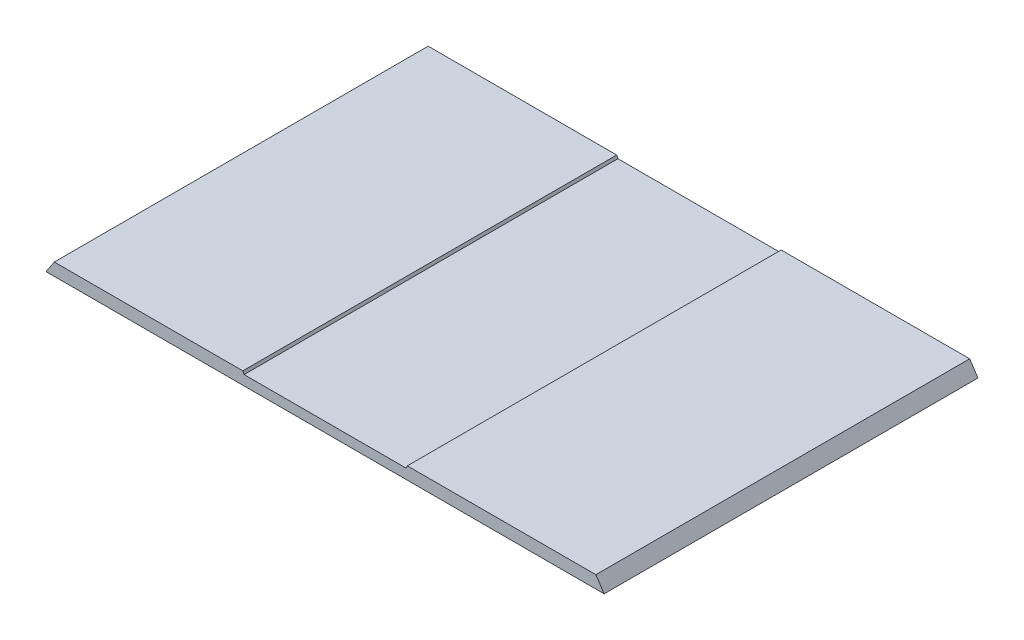
ISO-10303-21;
HEADER;
FILE_DESCRIPTION(('STEP AP214'),'2;1');
FILE_NAME('part.step','',(''),(''),'','','');
FILE_SCHEMA(('AUTOMOTIVE_DESIGN { 1 0 10303 214 1 1 1 1 }'));
ENDSEC;
DATA;
#1=APPLICATION_CONTEXT('core data for automotive mechanical design processes');
#2=APPLICATION_PROTOCOL_DEFINITION('international standard','automotive_design',2000,#1);
#3=PRODUCT_CONTEXT('',#1,'mechanical');
#4=PRODUCT('Part','Part','',(#3));
#5=PRODUCT_RELATED_PRODUCT_CATEGORY('part','',(#4));
#6=PRODUCT_DEFINITION_FORMATION('','',#4);
#7=PRODUCT_DEFINITION_CONTEXT('part definition',#1,'design');
#8=PRODUCT_DEFINITION('design','',#6,#7);
#9=PRODUCT_DEFINITION_SHAPE('','',#8);
#10=(LENGTH_UNIT() NAMED_UNIT(*) SI_UNIT(.MILLI.,.METRE.));
#11=(NAMED_UNIT(*) PLANE_ANGLE_UNIT() SI_UNIT($,.RADIAN.));
#12=(NAMED_UNIT(*) SI_UNIT($,.STERADIAN.) SOLID_ANGLE_UNIT());
#13=UNCERTAINTY_MEASURE_WITH_UNIT(LENGTH_MEASURE(1.E-05),#10,'distance_accuracy_value','');
#14=(GEOMETRIC_REPRESENTATION_CONTEXT(3) GLOBAL_UNCERTAINTY_ASSIGNED_CONTEXT((#13)) GLOBAL_UNIT_ASSIGNED_CONTEXT((#10,
#11,#12)) REPRESENTATION_CONTEXT('',''));
#15=CARTESIAN_POINT('',(0.,0.,0.));
#16=DIRECTION('',(0.,0.,1.));
#17=DIRECTION('',(1.,0.,0.));
#18=AXIS2_PLACEMENT_3D('',#15,#16,#17);
#19=CARTESIAN_POINT('',(335.914239770225,-194.367647058824,450.));
#20=DIRECTION('',(0.,1.,0.));
#21=DIRECTION('',(0.,0.,1.));
#22=AXIS2_PLACEMENT_3D('',#19,#20,#21);
#23=PLANE('',#22);
#24=DIRECTION('',(1.,0.,0.));
#25=VECTOR('',#24,1.);
#26=CARTESIAN_POINT('',(335.914239770225,-194.367647058824,0.));
#27=LINE('',#26,#25);
#28=CARTESIAN_POINT('',(-335.914239770225,-194.367647058824,0.));
#29=VERTEX_POINT('',#28);
#30=CARTESIAN_POINT('',(335.914239770225,-194.367647058824,0.));
#31=VERTEX_POINT('',#30);
#32=EDGE_CURVE('E129',#29,#31,#27,.T.);
#33=ORIENTED_EDGE('',*,*,#32,.T.);
#34=DIRECTION('',(0.,0.,-1.));
#35=VECTOR('',#34,1.);
#36=CARTESIAN_POINT('',(335.914239770225,-194.367647058824,450.));
#37=LINE('',#36,#35);
#38=CARTESIAN_POINT('',(335.914239770225,-194.367647058824,450.));
#39=VERTEX_POINT('',#38);
#40=EDGE_CURVE('E11',#39,#31,#37,.T.);
#41=ORIENTED_EDGE('',*,*,#40,.F.);
#42=DIRECTION('',(1.,0.,0.));
#43=VECTOR('',#42,1.);
#44=CARTESIAN_POINT('',(335.914239770225,-194.367647058824,450.));
#45=LINE('',#44,#43);
#46=CARTESIAN_POINT('',(-335.914239770225,-194.367647058824,450.));
#47=VERTEX_POINT('',#46);
#48=EDGE_CURVE('E143',#47,#39,#45,.T.);
#49=ORIENTED_EDGE('',*,*,#48,.F.);
#50=DIRECTION('',(0.,0.,-1.));
#51=VECTOR('',#50,1.);
#52=CARTESIAN_POINT('',(-335.914239770225,-194.367647058824,450.));
#53=LINE('',#52,#51);
#54=EDGE_CURVE('E125',#47,#29,#53,.T.);
#55=ORIENTED_EDGE('',*,*,#54,.T.);
#56=EDGE_LOOP('',(#33,#41,#49,#55));
#57=FACE_BOUND('',#56,.T.);
#58=ADVANCED_FACE('F33',(#57),#23,.F.);
#59=CARTESIAN_POINT('',(325.914239770225,-179.367647058824,450.));
#60=DIRECTION('',(-0.832050294337846,-0.554700196225226,0.));
#61=DIRECTION('',(0.554700196225226,-0.832050294337846,0.));
#62=AXIS2_PLACEMENT_3D('',#59,#60,#61);
#63=PLANE('',#62);
#64=DIRECTION('',(-0.554700196225226,0.832050294337846,0.));
#65=VECTOR('',#64,1.);
#66=CARTESIAN_POINT('',(325.914239770225,-179.367647058824,0.));
#67=LINE('',#66,#65);
#68=CARTESIAN_POINT('',(325.914239770225,-179.367647058824,0.));
#69=VERTEX_POINT('',#68);
#70=EDGE_CURVE('E132',#31,#69,#67,.T.);
#71=ORIENTED_EDGE('',*,*,#70,.T.);
#72=DIRECTION('',(0.,0.,-1.));
#73=VECTOR('',#72,1.);
#74=CARTESIAN_POINT('',(325.914239770225,-179.367647058824,450.));
#75=LINE('',#74,#73);
#76=CARTESIAN_POINT('',(325.914239770225,-179.367647058824,450.));
#77=VERTEX_POINT('',#76);
#78=EDGE_CURVE('E41',#77,#69,#75,.T.);
#79=ORIENTED_EDGE('',*,*,#78,.F.);
#80=DIRECTION('',(-0.554700196225226,0.832050294337846,0.));
#81=VECTOR('',#80,1.);
#82=CARTESIAN_POINT('',(325.914239770225,-179.367647058824,450.));
#83=LINE('',#82,#81);
#84=EDGE_CURVE('E92',#39,#77,#83,.T.);
#85=ORIENTED_EDGE('',*,*,#84,.F.);
#86=ORIENTED_EDGE('',*,*,#40,.T.);
#87=EDGE_LOOP('',(#71,#79,#85,#86));
#88=FACE_BOUND('',#87,.T.);
#89=ADVANCED_FACE('F178',(#88),#63,.F.);
#90=CARTESIAN_POINT('',(98.9999999999999,-179.367647058824,450.));
#91=DIRECTION('',(0.,-1.,0.));
#92=DIRECTION('',(0.,0.,-1.));
#93=AXIS2_PLACEMENT_3D('',#90,#91,#92);
#94=PLANE('',#93);
#95=DIRECTION('',(-1.,0.,0.));
#96=VECTOR('',#95,1.);
#97=CARTESIAN_POINT('',(98.9999999999999,-179.367647058824,0.));
#98=LINE('',#97,#96);
#99=CARTESIAN_POINT('',(98.9999999999999,-179.367647058824,0.));
#100=VERTEX_POINT('',#99);
#101=EDGE_CURVE('E134',#69,#100,#98,.T.);
#102=ORIENTED_EDGE('',*,*,#101,.T.);
#103=DIRECTION('',(0.,0.,-1.));
#104=VECTOR('',#103,1.);
#105=CARTESIAN_POINT('',(98.9999999999999,-179.367647058824,450.));
#106=LINE('',#105,#104);
#107=CARTESIAN_POINT('',(98.9999999999999,-179.367647058824,450.));
#108=VERTEX_POINT('',#107);
#109=EDGE_CURVE('E150',#108,#100,#106,.T.);
#110=ORIENTED_EDGE('',*,*,#109,.F.);
#111=DIRECTION('',(-1.,0.,0.));
#112=VECTOR('',#111,1.);
#113=CARTESIAN_POINT('',(98.9999999999999,-179.367647058824,450.));
#114=LINE('',#113,#112);
#115=EDGE_CURVE('E158',#77,#108,#114,.T.);
#116=ORIENTED_EDGE('',*,*,#115,.F.);
#117=ORIENTED_EDGE('',*,*,#78,.T.);
#118=EDGE_LOOP('',(#102,#110,#116,#117));
#119=FACE_BOUND('',#118,.T.);
#120=ADVANCED_FACE('F156',(#119),#94,.F.);
#121=CARTESIAN_POINT('',(98.9999999999999,-179.367647058824,450.));
#122=DIRECTION('',(0.901919134345838,-0.431904937574062,0.));
#123=DIRECTION('',(0.431904937574062,0.901919134345838,0.));
#124=AXIS2_PLACEMENT_3D('',#121,#122,#123);
#125=PLANE('',#124);
#126=DIRECTION('',(-0.431904937574062,-0.901919134345838,0.));
#127=VECTOR('',#126,1.);
#128=CARTESIAN_POINT('',(98.9999999999999,-179.367647058824,0.));
#129=LINE('',#128,#127);
#130=CARTESIAN_POINT('',(97.5,-182.5,0.));
#131=VERTEX_POINT('',#130);
#132=EDGE_CURVE('E136',#100,#131,#129,.T.);
#133=ORIENTED_EDGE('',*,*,#132,.T.);
#134=DIRECTION('',(0.,0.,-1.));
#135=VECTOR('',#134,1.);
#136=CARTESIAN_POINT('',(97.5,-182.5,450.));
#137=LINE('',#136,#135);
#138=CARTESIAN_POINT('',(97.5,-182.5,450.));
#139=VERTEX_POINT('',#138);
#140=EDGE_CURVE('E147',#139,#131,#137,.T.);
#141=ORIENTED_EDGE('',*,*,#140,.F.);
#142=DIRECTION('',(-0.431904937574062,-0.901919134345838,0.));
#143=VECTOR('',#142,1.);
#144=CARTESIAN_POINT('',(98.9999999999999,-179.367647058824,450.));
#145=LINE('',#144,#143);
#146=EDGE_CURVE('E170',#108,#139,#145,.T.);
#147=ORIENTED_EDGE('',*,*,#146,.F.);
#148=ORIENTED_EDGE('',*,*,#109,.T.);
#149=EDGE_LOOP('',(#133,#141,#147,#148));
#150=FACE_BOUND('',#149,.T.);
#151=ADVANCED_FACE('F166',(#150),#125,.F.);
#152=CARTESIAN_POINT('',(97.5,-182.5,450.));
#153=DIRECTION('',(0.,-1.,0.));
#154=DIRECTION('',(0.,0.,-1.));
#155=AXIS2_PLACEMENT_3D('',#152,#153,#154);
#156=PLANE('',#155);
#157=DIRECTION('',(-1.,0.,0.));
#158=VECTOR('',#157,1.);
#159=CARTESIAN_POINT('',(97.5,-182.5,0.));
#160=LINE('',#159,#158);
#161=CARTESIAN_POINT('',(-97.5,-182.5,0.));
#162=VERTEX_POINT('',#161);
#163=EDGE_CURVE('E138',#131,#162,#160,.T.);
#164=ORIENTED_EDGE('',*,*,#163,.T.);
#165=DIRECTION('',(0.,0.,-1.));
#166=VECTOR('',#165,1.);
#167=CARTESIAN_POINT('',(-97.5,-182.5,450.));
#168=LINE('',#167,#166);
#169=CARTESIAN_POINT('',(-97.5,-182.5,450.));
#170=VERTEX_POINT('',#169);
#171=EDGE_CURVE('E120',#170,#162,#168,.T.);
#172=ORIENTED_EDGE('',*,*,#171,.F.);
#173=DIRECTION('',(-1.,0.,0.));
#174=VECTOR('',#173,1.);
#175=CARTESIAN_POINT('',(97.5,-182.5,450.));
#176=LINE('',#175,#174);
#177=EDGE_CURVE('E111',#139,#170,#176,.T.);
#178=ORIENTED_EDGE('',*,*,#177,.F.);
#179=ORIENTED_EDGE('',*,*,#140,.T.);
#180=EDGE_LOOP('',(#164,#172,#178,#179));
#181=FACE_BOUND('',#180,.T.);
#182=ADVANCED_FACE('F169',(#181),#156,.F.);
#183=CARTESIAN_POINT('',(-98.9999999999999,-179.367647058824,450.));
#184=DIRECTION('',(-0.901919134345838,-0.431904937574062,0.));
#185=DIRECTION('',(0.431904937574062,-0.901919134345838,0.));
#186=AXIS2_PLACEMENT_3D('',#183,#184,#185);
#187=PLANE('',#186);
#188=DIRECTION('',(-0.431904937574062,0.901919134345838,0.));
#189=VECTOR('',#188,1.);
#190=CARTESIAN_POINT('',(-98.9999999999999,-179.367647058824,0.));
#191=LINE('',#190,#189);
#192=CARTESIAN_POINT('',(-98.9999999999999,-179.367647058824,0.));
#193=VERTEX_POINT('',#192);
#194=EDGE_CURVE('E119',#162,#193,#191,.T.);
#195=ORIENTED_EDGE('',*,*,#194,.T.);
#196=DIRECTION('',(0.,0.,-1.));
#197=VECTOR('',#196,1.);
#198=CARTESIAN_POINT('',(-98.9999999999999,-179.367647058824,450.));
#199=LINE('',#198,#197);
#200=CARTESIAN_POINT('',(-98.9999999999999,-179.367647058824,450.));
#201=VERTEX_POINT('',#200);
#202=EDGE_CURVE('E116',#201,#193,#199,.T.);
#203=ORIENTED_EDGE('',*,*,#202,.F.);
#204=DIRECTION('',(-0.431904937574062,0.901919134345838,0.));
#205=VECTOR('',#204,1.);
#206=CARTESIAN_POINT('',(-98.9999999999999,-179.367647058824,450.));
#207=LINE('',#206,#205);
#208=EDGE_CURVE('E105',#170,#201,#207,.T.);
#209=ORIENTED_EDGE('',*,*,#208,.F.);
#210=ORIENTED_EDGE('',*,*,#171,.T.);
#211=EDGE_LOOP('',(#195,#203,#209,#210));
#212=FACE_BOUND('',#211,.T.);
#213=ADVANCED_FACE('F117',(#212),#187,.F.);
#214=CARTESIAN_POINT('',(-98.9999999999999,-179.367647058824,450.));
#215=DIRECTION('',(0.,-1.,0.));
#216=DIRECTION('',(0.,0.,-1.));
#217=AXIS2_PLACEMENT_3D('',#214,#215,#216);
#218=PLANE('',#217);
#219=DIRECTION('',(-1.,0.,0.));
#220=VECTOR('',#219,1.);
#221=CARTESIAN_POINT('',(-98.9999999999999,-179.367647058824,0.));
#222=LINE('',#221,#220);
#223=CARTESIAN_POINT('',(-325.914239770225,-179.367647058824,0.));
#224=VERTEX_POINT('',#223);
#225=EDGE_CURVE('E78',#193,#224,#222,.T.);
#226=ORIENTED_EDGE('',*,*,#225,.T.);
#227=DIRECTION('',(0.,0.,-1.));
#228=VECTOR('',#227,1.);
#229=CARTESIAN_POINT('',(-325.914239770225,-179.367647058824,450.));
#230=LINE('',#229,#228);
#231=CARTESIAN_POINT('',(-325.914239770225,-179.367647058824,450.));
#232=VERTEX_POINT('',#231);
#233=EDGE_CURVE('E121',#232,#224,#230,.T.);
#234=ORIENTED_EDGE('',*,*,#233,.F.);
#235=DIRECTION('',(-1.,0.,0.));
#236=VECTOR('',#235,1.);
#237=CARTESIAN_POINT('',(-98.9999999999999,-179.367647058824,450.));
#238=LINE('',#237,#236);
#239=EDGE_CURVE('E109',#201,#232,#238,.T.);
#240=ORIENTED_EDGE('',*,*,#239,.F.);
#241=ORIENTED_EDGE('',*,*,#202,.T.);
#242=EDGE_LOOP('',(#226,#234,#240,#241));
#243=FACE_BOUND('',#242,.T.);
#244=ADVANCED_FACE('F123',(#243),#218,.F.);
#245=CARTESIAN_POINT('',(-325.914239770225,-179.367647058824,450.));
#246=DIRECTION('',(0.832050294337846,-0.554700196225226,0.));
#247=DIRECTION('',(0.554700196225226,0.832050294337846,0.));
#248=AXIS2_PLACEMENT_3D('',#245,#246,#247);
#249=PLANE('',#248);
#250=DIRECTION('',(-0.554700196225226,-0.832050294337846,0.));
#251=VECTOR('',#250,1.);
#252=CARTESIAN_POINT('',(-325.914239770225,-179.367647058824,0.));
#253=LINE('',#252,#251);
#254=EDGE_CURVE('E84',#224,#29,#253,.T.);
#255=ORIENTED_EDGE('',*,*,#254,.T.);
#256=ORIENTED_EDGE('',*,*,#54,.F.);
#257=DIRECTION('',(-0.554700196225226,-0.832050294337846,0.));
#258=VECTOR('',#257,1.);
#259=CARTESIAN_POINT('',(-325.914239770225,-179.367647058824,450.));
#260=LINE('',#259,#258);
#261=EDGE_CURVE('E49',#232,#47,#260,.T.);
#262=ORIENTED_EDGE('',*,*,#261,.F.);
#263=ORIENTED_EDGE('',*,*,#233,.T.);
#264=EDGE_LOOP('',(#255,#256,#262,#263));
#265=FACE_BOUND('',#264,.T.);
#266=ADVANCED_FACE('F194',(#265),#249,.F.);
#267=CARTESIAN_POINT('',(0.,0.,450.));
#268=DIRECTION('',(0.,0.,1.));
#269=DIRECTION('',(1.,0.,0.));
#270=AXIS2_PLACEMENT_3D('',#267,#268,#269);
#271=PLANE('',#270);
#272=ORIENTED_EDGE('',*,*,#48,.T.);
#273=ORIENTED_EDGE('',*,*,#84,.T.);
#274=ORIENTED_EDGE('',*,*,#115,.T.);
#275=ORIENTED_EDGE('',*,*,#146,.T.);
#276=ORIENTED_EDGE('',*,*,#177,.T.);
#277=ORIENTED_EDGE('',*,*,#208,.T.);
#278=ORIENTED_EDGE('',*,*,#239,.T.);
#279=ORIENTED_EDGE('',*,*,#261,.T.);
#280=EDGE_LOOP('',(#272,#273,#274,#275,#276,#277,#278,#279));
#281=FACE_BOUND('',#280,.T.);
#282=ADVANCED_FACE('F107',(#281),#271,.T.);
#283=CARTESIAN_POINT('',(0.,0.,0.));
#284=DIRECTION('',(0.,0.,1.));
#285=DIRECTION('',(1.,0.,0.));
#286=AXIS2_PLACEMENT_3D('',#283,#284,#285);
#287=PLANE('',#286);
#288=ORIENTED_EDGE('',*,*,#32,.F.);
#289=ORIENTED_EDGE('',*,*,#254,.F.);
#290=ORIENTED_EDGE('',*,*,#225,.F.);
#291=ORIENTED_EDGE('',*,*,#194,.F.);
#292=ORIENTED_EDGE('',*,*,#163,.F.);
#293=ORIENTED_EDGE('',*,*,#132,.F.);
#294=ORIENTED_EDGE('',*,*,#101,.F.);
#295=ORIENTED_EDGE('',*,*,#70,.F.);
#296=EDGE_LOOP('',(#288,#289,#290,#291,#292,#293,#294,#295));
#297=FACE_BOUND('',#296,.T.);
#298=ADVANCED_FACE('F162',(#297),#287,.F.);
#299=CLOSED_SHELL('',(#58,#89,#120,#151,#182,#213,#244,#266,#282,#298));
#300=MANIFOLD_SOLID_BREP('B2',#299);
#301=ADVANCED_BREP_SHAPE_REPRESENTATION('',(#18,#300),#14);
#302=SHAPE_DEFINITION_REPRESENTATION(#9,#301);
ENDSEC;
END-ISO-10303-21;
